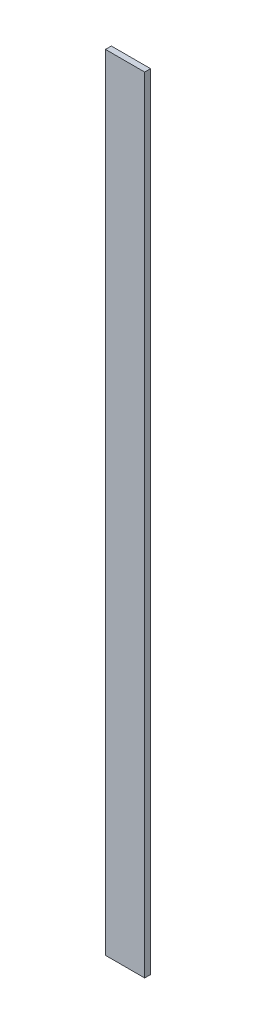
ISO-10303-21;
HEADER;
FILE_DESCRIPTION(('STEP AP214'),'2;1');
FILE_NAME('part.step','',(''),(''),'','','');
FILE_SCHEMA(('AUTOMOTIVE_DESIGN { 1 0 10303 214 1 1 1 1 }'));
ENDSEC;
DATA;
#1=APPLICATION_CONTEXT('core data for automotive mechanical design processes');
#2=APPLICATION_PROTOCOL_DEFINITION('international standard','automotive_design',2000,#1);
#3=PRODUCT_CONTEXT('',#1,'mechanical');
#4=PRODUCT('Part','Part','',(#3));
#5=PRODUCT_RELATED_PRODUCT_CATEGORY('part','',(#4));
#6=PRODUCT_DEFINITION_FORMATION('','',#4);
#7=PRODUCT_DEFINITION_CONTEXT('part definition',#1,'design');
#8=PRODUCT_DEFINITION('design','',#6,#7);
#9=PRODUCT_DEFINITION_SHAPE('','',#8);
#10=(LENGTH_UNIT() NAMED_UNIT(*) SI_UNIT(.MILLI.,.METRE.));
#11=(NAMED_UNIT(*) PLANE_ANGLE_UNIT() SI_UNIT($,.RADIAN.));
#12=(NAMED_UNIT(*) SI_UNIT($,.STERADIAN.) SOLID_ANGLE_UNIT());
#13=UNCERTAINTY_MEASURE_WITH_UNIT(LENGTH_MEASURE(1.E-05),#10,'distance_accuracy_value','');
#14=(GEOMETRIC_REPRESENTATION_CONTEXT(3) GLOBAL_UNCERTAINTY_ASSIGNED_CONTEXT((#13)) GLOBAL_UNIT_ASSIGNED_CONTEXT((#10,
#11,#12)) REPRESENTATION_CONTEXT('',''));
#15=CARTESIAN_POINT('',(0.,0.,0.));
#16=DIRECTION('',(0.,0.,1.));
#17=DIRECTION('',(1.,0.,0.));
#18=AXIS2_PLACEMENT_3D('',#15,#16,#17);
#19=CARTESIAN_POINT('',(0.,0.,3.));
#20=DIRECTION('',(1.,0.,0.));
#21=DIRECTION('',(0.,0.,-1.));
#22=AXIS2_PLACEMENT_3D('',#19,#20,#21);
#23=PLANE('',#22);
#24=DIRECTION('',(0.,-1.,0.));
#25=VECTOR('',#24,1.);
#26=CARTESIAN_POINT('',(0.,0.,0.));
#27=LINE('',#26,#25);
#28=CARTESIAN_POINT('',(0.,400.,0.));
#29=VERTEX_POINT('',#28);
#30=CARTESIAN_POINT('',(0.,0.,0.));
#31=VERTEX_POINT('',#30);
#32=EDGE_CURVE('E98',#29,#31,#27,.T.);
#33=ORIENTED_EDGE('',*,*,#32,.T.);
#34=DIRECTION('',(0.,0.,-1.));
#35=VECTOR('',#34,1.);
#36=CARTESIAN_POINT('',(0.,0.,3.));
#37=LINE('',#36,#35);
#38=CARTESIAN_POINT('',(0.,0.,3.));
#39=VERTEX_POINT('',#38);
#40=EDGE_CURVE('E11',#39,#31,#37,.T.);
#41=ORIENTED_EDGE('',*,*,#40,.F.);
#42=DIRECTION('',(0.,-1.,0.));
#43=VECTOR('',#42,1.);
#44=CARTESIAN_POINT('',(0.,0.,3.));
#45=LINE('',#44,#43);
#46=CARTESIAN_POINT('',(0.,400.,3.));
#47=VERTEX_POINT('',#46);
#48=EDGE_CURVE('E86',#47,#39,#45,.T.);
#49=ORIENTED_EDGE('',*,*,#48,.F.);
#50=DIRECTION('',(0.,0.,-1.));
#51=VECTOR('',#50,1.);
#52=CARTESIAN_POINT('',(0.,400.,3.));
#53=LINE('',#52,#51);
#54=EDGE_CURVE('E94',#47,#29,#53,.T.);
#55=ORIENTED_EDGE('',*,*,#54,.T.);
#56=EDGE_LOOP('',(#33,#41,#49,#55));
#57=FACE_BOUND('',#56,.T.);
#58=ADVANCED_FACE('F35',(#57),#23,.F.);
#59=CARTESIAN_POINT('',(0.,0.,3.));
#60=DIRECTION('',(0.,1.,0.));
#61=DIRECTION('',(0.,0.,1.));
#62=AXIS2_PLACEMENT_3D('',#59,#60,#61);
#63=PLANE('',#62);
#64=DIRECTION('',(1.,0.,0.));
#65=VECTOR('',#64,1.);
#66=CARTESIAN_POINT('',(0.,0.,0.));
#67=LINE('',#66,#65);
#68=CARTESIAN_POINT('',(20.,0.,0.));
#69=VERTEX_POINT('',#68);
#70=EDGE_CURVE('E90',#31,#69,#67,.T.);
#71=ORIENTED_EDGE('',*,*,#70,.T.);
#72=DIRECTION('',(0.,0.,-1.));
#73=VECTOR('',#72,1.);
#74=CARTESIAN_POINT('',(20.,0.,3.));
#75=LINE('',#74,#73);
#76=CARTESIAN_POINT('',(20.,0.,3.));
#77=VERTEX_POINT('',#76);
#78=EDGE_CURVE('E43',#77,#69,#75,.T.);
#79=ORIENTED_EDGE('',*,*,#78,.F.);
#80=DIRECTION('',(1.,0.,0.));
#81=VECTOR('',#80,1.);
#82=CARTESIAN_POINT('',(0.,0.,3.));
#83=LINE('',#82,#81);
#84=EDGE_CURVE('E81',#39,#77,#83,.T.);
#85=ORIENTED_EDGE('',*,*,#84,.F.);
#86=ORIENTED_EDGE('',*,*,#40,.T.);
#87=EDGE_LOOP('',(#71,#79,#85,#86));
#88=FACE_BOUND('',#87,.T.);
#89=ADVANCED_FACE('F89',(#88),#63,.F.);
#90=CARTESIAN_POINT('',(20.,0.,3.));
#91=DIRECTION('',(-1.,0.,0.));
#92=DIRECTION('',(0.,0.,1.));
#93=AXIS2_PLACEMENT_3D('',#90,#91,#92);
#94=PLANE('',#93);
#95=DIRECTION('',(0.,1.,0.));
#96=VECTOR('',#95,1.);
#97=CARTESIAN_POINT('',(20.,0.,0.));
#98=LINE('',#97,#96);
#99=CARTESIAN_POINT('',(20.,400.,0.));
#100=VERTEX_POINT('',#99);
#101=EDGE_CURVE('E68',#69,#100,#98,.T.);
#102=ORIENTED_EDGE('',*,*,#101,.T.);
#103=DIRECTION('',(0.,0.,-1.));
#104=VECTOR('',#103,1.);
#105=CARTESIAN_POINT('',(20.,400.,3.));
#106=LINE('',#105,#104);
#107=CARTESIAN_POINT('',(20.,400.,3.));
#108=VERTEX_POINT('',#107);
#109=EDGE_CURVE('E91',#108,#100,#106,.T.);
#110=ORIENTED_EDGE('',*,*,#109,.F.);
#111=DIRECTION('',(0.,1.,0.));
#112=VECTOR('',#111,1.);
#113=CARTESIAN_POINT('',(20.,0.,3.));
#114=LINE('',#113,#112);
#115=EDGE_CURVE('E84',#77,#108,#114,.T.);
#116=ORIENTED_EDGE('',*,*,#115,.F.);
#117=ORIENTED_EDGE('',*,*,#78,.T.);
#118=EDGE_LOOP('',(#102,#110,#116,#117));
#119=FACE_BOUND('',#118,.T.);
#120=ADVANCED_FACE('F92',(#119),#94,.F.);
#121=CARTESIAN_POINT('',(0.,400.,3.));
#122=DIRECTION('',(0.,-1.,0.));
#123=DIRECTION('',(0.,0.,-1.));
#124=AXIS2_PLACEMENT_3D('',#121,#122,#123);
#125=PLANE('',#124);
#126=DIRECTION('',(-1.,0.,0.));
#127=VECTOR('',#126,1.);
#128=CARTESIAN_POINT('',(0.,400.,0.));
#129=LINE('',#128,#127);
#130=EDGE_CURVE('E74',#100,#29,#129,.T.);
#131=ORIENTED_EDGE('',*,*,#130,.T.);
#132=ORIENTED_EDGE('',*,*,#54,.F.);
#133=DIRECTION('',(-1.,0.,0.));
#134=VECTOR('',#133,1.);
#135=CARTESIAN_POINT('',(0.,400.,3.));
#136=LINE('',#135,#134);
#137=EDGE_CURVE('E51',#108,#47,#136,.T.);
#138=ORIENTED_EDGE('',*,*,#137,.F.);
#139=ORIENTED_EDGE('',*,*,#109,.T.);
#140=EDGE_LOOP('',(#131,#132,#138,#139));
#141=FACE_BOUND('',#140,.T.);
#142=ADVANCED_FACE('F105',(#141),#125,.F.);
#143=CARTESIAN_POINT('',(0.,0.,3.));
#144=DIRECTION('',(0.,0.,-1.));
#145=DIRECTION('',(-1.,0.,0.));
#146=AXIS2_PLACEMENT_3D('',#143,#144,#145);
#147=PLANE('',#146);
#148=ORIENTED_EDGE('',*,*,#48,.T.);
#149=ORIENTED_EDGE('',*,*,#84,.T.);
#150=ORIENTED_EDGE('',*,*,#115,.T.);
#151=ORIENTED_EDGE('',*,*,#137,.T.);
#152=EDGE_LOOP('',(#148,#149,#150,#151));
#153=FACE_BOUND('',#152,.T.);
#154=ADVANCED_FACE('F82',(#153),#147,.F.);
#155=CARTESIAN_POINT('',(0.,0.,0.));
#156=DIRECTION('',(0.,0.,-1.));
#157=DIRECTION('',(-1.,0.,0.));
#158=AXIS2_PLACEMENT_3D('',#155,#156,#157);
#159=PLANE('',#158);
#160=ORIENTED_EDGE('',*,*,#32,.F.);
#161=ORIENTED_EDGE('',*,*,#130,.F.);
#162=ORIENTED_EDGE('',*,*,#101,.F.);
#163=ORIENTED_EDGE('',*,*,#70,.F.);
#164=EDGE_LOOP('',(#160,#161,#162,#163));
#165=FACE_BOUND('',#164,.T.);
#166=ADVANCED_FACE('F108',(#165),#159,.T.);
#167=CLOSED_SHELL('',(#58,#89,#120,#142,#154,#166));
#168=MANIFOLD_SOLID_BREP('B2',#167);
#169=ADVANCED_BREP_SHAPE_REPRESENTATION('',(#18,#168),#14);
#170=SHAPE_DEFINITION_REPRESENTATION(#9,#169);
ENDSEC;
END-ISO-10303-21;
